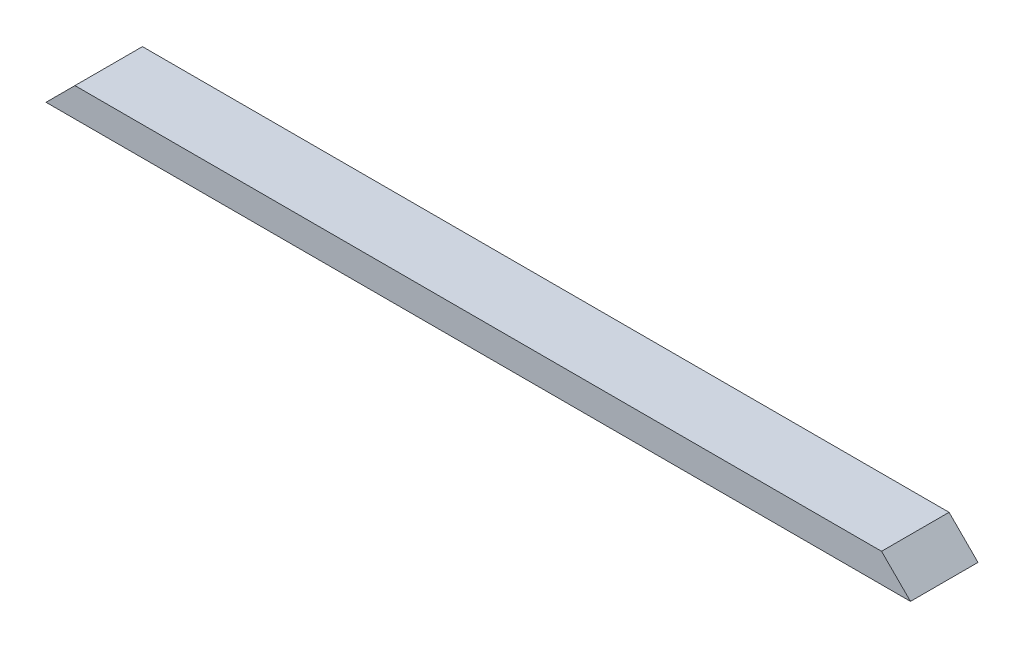
ISO-10303-21;
HEADER;
FILE_DESCRIPTION(('STEP AP214'),'2;1');
FILE_NAME('part.step','',(''),(''),'','','');
FILE_SCHEMA(('AUTOMOTIVE_DESIGN { 1 0 10303 214 1 1 1 1 }'));
ENDSEC;
DATA;
#1=APPLICATION_CONTEXT('core data for automotive mechanical design processes');
#2=APPLICATION_PROTOCOL_DEFINITION('international standard','automotive_design',2000,#1);
#3=PRODUCT_CONTEXT('',#1,'mechanical');
#4=PRODUCT('Part','Part','',(#3));
#5=PRODUCT_RELATED_PRODUCT_CATEGORY('part','',(#4));
#6=PRODUCT_DEFINITION_FORMATION('','',#4);
#7=PRODUCT_DEFINITION_CONTEXT('part definition',#1,'design');
#8=PRODUCT_DEFINITION('design','',#6,#7);
#9=PRODUCT_DEFINITION_SHAPE('','',#8);
#10=(LENGTH_UNIT() NAMED_UNIT(*) SI_UNIT(.MILLI.,.METRE.));
#11=(NAMED_UNIT(*) PLANE_ANGLE_UNIT() SI_UNIT($,.RADIAN.));
#12=(NAMED_UNIT(*) SI_UNIT($,.STERADIAN.) SOLID_ANGLE_UNIT());
#13=UNCERTAINTY_MEASURE_WITH_UNIT(LENGTH_MEASURE(1.E-05),#10,'distance_accuracy_value','');
#14=(GEOMETRIC_REPRESENTATION_CONTEXT(3) GLOBAL_UNCERTAINTY_ASSIGNED_CONTEXT((#13)) GLOBAL_UNIT_ASSIGNED_CONTEXT((#10,
#11,#12)) REPRESENTATION_CONTEXT('',''));
#15=CARTESIAN_POINT('',(0.,0.,0.));
#16=DIRECTION('',(0.,0.,1.));
#17=DIRECTION('',(1.,0.,0.));
#18=AXIS2_PLACEMENT_3D('',#15,#16,#17);
#19=CARTESIAN_POINT('',(0.,38.1,0.));
#20=DIRECTION('',(0.,0.,-1.));
#21=DIRECTION('',(-1.,0.,0.));
#22=AXIS2_PLACEMENT_3D('',#19,#20,#21);
#23=PLANE('',#22);
#24=DIRECTION('',(1.,0.,0.));
#25=VECTOR('',#24,1.);
#26=CARTESIAN_POINT('',(0.,38.1,0.));
#27=LINE('',#26,#25);
#28=CARTESIAN_POINT('',(38.1,38.1,0.));
#29=VERTEX_POINT('',#28);
#30=CARTESIAN_POINT('',(1100.1375,38.1,0.));
#31=VERTEX_POINT('',#30);
#32=EDGE_CURVE('E52',#29,#31,#27,.T.);
#33=ORIENTED_EDGE('',*,*,#32,.F.);
#34=DIRECTION('',(0.707106781186547,0.707106781186547,0.));
#35=VECTOR('',#34,1.);
#36=CARTESIAN_POINT('',(0.,0.,0.));
#37=LINE('',#36,#35);
#38=CARTESIAN_POINT('',(0.,0.,0.));
#39=VERTEX_POINT('',#38);
#40=EDGE_CURVE('E87',#39,#29,#37,.T.);
#41=ORIENTED_EDGE('',*,*,#40,.F.);
#42=DIRECTION('',(1.,0.,0.));
#43=VECTOR('',#42,1.);
#44=CARTESIAN_POINT('',(0.,0.,0.));
#45=LINE('',#44,#43);
#46=CARTESIAN_POINT('',(1138.2375,0.,0.));
#47=VERTEX_POINT('',#46);
#48=EDGE_CURVE('E93',#39,#47,#45,.T.);
#49=ORIENTED_EDGE('',*,*,#48,.T.);
#50=DIRECTION('',(0.707106781186548,-0.707106781186547,0.));
#51=VECTOR('',#50,1.);
#52=CARTESIAN_POINT('',(1100.1375,38.1,0.));
#53=LINE('',#52,#51);
#54=EDGE_CURVE('E68',#31,#47,#53,.T.);
#55=ORIENTED_EDGE('',*,*,#54,.F.);
#56=EDGE_LOOP('',(#33,#41,#49,#55));
#57=FACE_BOUND('',#56,.T.);
#58=ADVANCED_FACE('F43',(#57),#23,.F.);
#59=CARTESIAN_POINT('',(0.,38.1,-88.9));
#60=DIRECTION('',(0.,0.,1.));
#61=DIRECTION('',(1.,0.,0.));
#62=AXIS2_PLACEMENT_3D('',#59,#60,#61);
#63=PLANE('',#62);
#64=DIRECTION('',(-1.,0.,0.));
#65=VECTOR('',#64,1.);
#66=CARTESIAN_POINT('',(0.,0.,-88.9));
#67=LINE('',#66,#65);
#68=CARTESIAN_POINT('',(1138.2375,0.,-88.9));
#69=VERTEX_POINT('',#68);
#70=CARTESIAN_POINT('',(0.,0.,-88.9));
#71=VERTEX_POINT('',#70);
#72=EDGE_CURVE('E46',#69,#71,#67,.T.);
#73=ORIENTED_EDGE('',*,*,#72,.T.);
#74=DIRECTION('',(0.707106781186547,0.707106781186547,0.));
#75=VECTOR('',#74,1.);
#76=CARTESIAN_POINT('',(0.,0.,-88.9));
#77=LINE('',#76,#75);
#78=CARTESIAN_POINT('',(38.1,38.1,-88.9));
#79=VERTEX_POINT('',#78);
#80=EDGE_CURVE('E60',#71,#79,#77,.T.);
#81=ORIENTED_EDGE('',*,*,#80,.T.);
#82=DIRECTION('',(-1.,0.,0.));
#83=VECTOR('',#82,1.);
#84=CARTESIAN_POINT('',(0.,38.1,-88.9));
#85=LINE('',#84,#83);
#86=CARTESIAN_POINT('',(1100.1375,38.1,-88.9));
#87=VERTEX_POINT('',#86);
#88=EDGE_CURVE('E11',#87,#79,#85,.T.);
#89=ORIENTED_EDGE('',*,*,#88,.F.);
#90=DIRECTION('',(0.707106781186548,-0.707106781186547,0.));
#91=VECTOR('',#90,1.);
#92=CARTESIAN_POINT('',(1100.1375,38.1,-88.9));
#93=LINE('',#92,#91);
#94=EDGE_CURVE('E111',#87,#69,#93,.T.);
#95=ORIENTED_EDGE('',*,*,#94,.T.);
#96=EDGE_LOOP('',(#73,#81,#89,#95));
#97=FACE_BOUND('',#96,.T.);
#98=ADVANCED_FACE('F126',(#97),#63,.F.);
#99=CARTESIAN_POINT('',(0.,38.1,0.));
#100=DIRECTION('',(0.,-1.,0.));
#101=DIRECTION('',(0.,0.,-1.));
#102=AXIS2_PLACEMENT_3D('',#99,#100,#101);
#103=PLANE('',#102);
#104=ORIENTED_EDGE('',*,*,#88,.T.);
#105=DIRECTION('',(0.,0.,1.));
#106=VECTOR('',#105,1.);
#107=CARTESIAN_POINT('',(38.1,38.1,-88.9));
#108=LINE('',#107,#106);
#109=EDGE_CURVE('E94',#79,#29,#108,.T.);
#110=ORIENTED_EDGE('',*,*,#109,.T.);
#111=ORIENTED_EDGE('',*,*,#32,.T.);
#112=DIRECTION('',(0.,0.,1.));
#113=VECTOR('',#112,1.);
#114=CARTESIAN_POINT('',(1100.1375,38.1,-88.9));
#115=LINE('',#114,#113);
#116=EDGE_CURVE('E115',#87,#31,#115,.T.);
#117=ORIENTED_EDGE('',*,*,#116,.F.);
#118=EDGE_LOOP('',(#104,#110,#111,#117));
#119=FACE_BOUND('',#118,.T.);
#120=ADVANCED_FACE('F129',(#119),#103,.F.);
#121=CARTESIAN_POINT('',(0.,0.,0.));
#122=DIRECTION('',(0.,-1.,0.));
#123=DIRECTION('',(0.,0.,-1.));
#124=AXIS2_PLACEMENT_3D('',#121,#122,#123);
#125=PLANE('',#124);
#126=DIRECTION('',(0.,0.,1.));
#127=VECTOR('',#126,1.);
#128=CARTESIAN_POINT('',(0.,0.,0.));
#129=LINE('',#128,#127);
#130=EDGE_CURVE('E84',#71,#39,#129,.T.);
#131=ORIENTED_EDGE('',*,*,#130,.F.);
#132=ORIENTED_EDGE('',*,*,#72,.F.);
#133=DIRECTION('',(0.,0.,-1.));
#134=VECTOR('',#133,1.);
#135=CARTESIAN_POINT('',(1138.2375,0.,0.));
#136=LINE('',#135,#134);
#137=EDGE_CURVE('E103',#47,#69,#136,.T.);
#138=ORIENTED_EDGE('',*,*,#137,.F.);
#139=ORIENTED_EDGE('',*,*,#48,.F.);
#140=EDGE_LOOP('',(#131,#132,#138,#139));
#141=FACE_BOUND('',#140,.T.);
#142=ADVANCED_FACE('F102',(#141),#125,.T.);
#143=CARTESIAN_POINT('',(1100.1375,38.1,-88.9));
#144=DIRECTION('',(-0.707106781186547,-0.707106781186548,0.));
#145=DIRECTION('',(0.707106781186548,-0.707106781186547,0.));
#146=AXIS2_PLACEMENT_3D('',#143,#144,#145);
#147=PLANE('',#146);
#148=ORIENTED_EDGE('',*,*,#54,.T.);
#149=ORIENTED_EDGE('',*,*,#137,.T.);
#150=ORIENTED_EDGE('',*,*,#94,.F.);
#151=ORIENTED_EDGE('',*,*,#116,.T.);
#152=EDGE_LOOP('',(#148,#149,#150,#151));
#153=FACE_BOUND('',#152,.T.);
#154=ADVANCED_FACE('F130',(#153),#147,.F.);
#155=CARTESIAN_POINT('',(0.,0.,-88.9));
#156=DIRECTION('',(0.707106781186547,-0.707106781186547,0.));
#157=DIRECTION('',(0.707106781186548,0.707106781186548,0.));
#158=AXIS2_PLACEMENT_3D('',#155,#156,#157);
#159=PLANE('',#158);
#160=ORIENTED_EDGE('',*,*,#40,.T.);
#161=ORIENTED_EDGE('',*,*,#109,.F.);
#162=ORIENTED_EDGE('',*,*,#80,.F.);
#163=ORIENTED_EDGE('',*,*,#130,.T.);
#164=EDGE_LOOP('',(#160,#161,#162,#163));
#165=FACE_BOUND('',#164,.T.);
#166=ADVANCED_FACE('F86',(#165),#159,.F.);
#167=CLOSED_SHELL('',(#58,#98,#120,#142,#154,#166));
#168=MANIFOLD_SOLID_BREP('B2',#167);
#169=ADVANCED_BREP_SHAPE_REPRESENTATION('',(#18,#168),#14);
#170=SHAPE_DEFINITION_REPRESENTATION(#9,#169);
ENDSEC;
END-ISO-10303-21;
